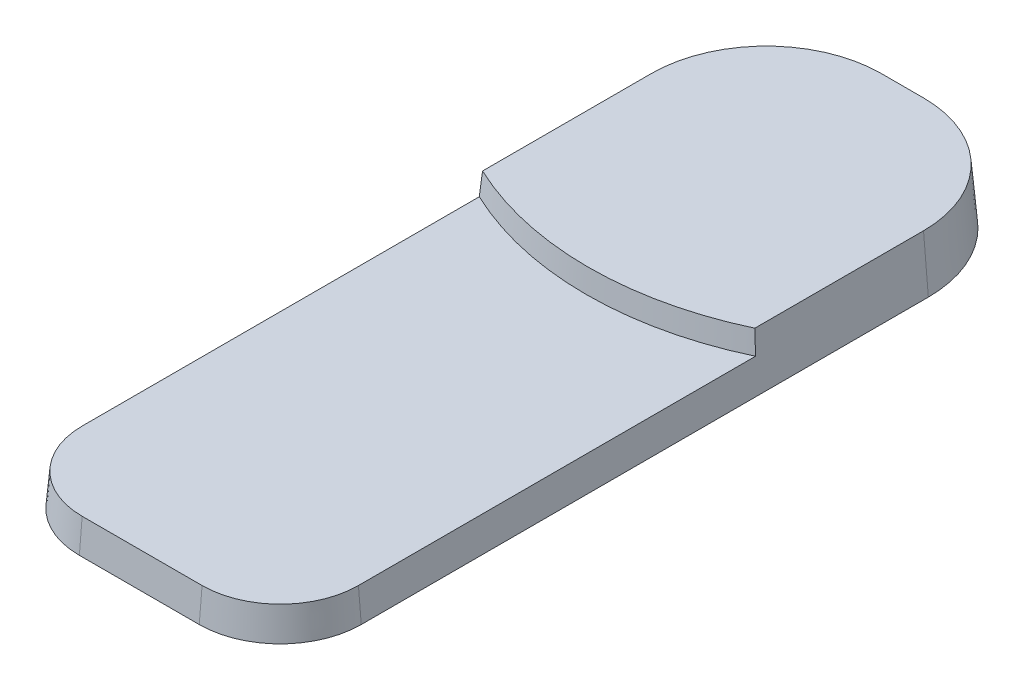
ISO-10303-21;
HEADER;
FILE_DESCRIPTION(('STEP AP214'),'2;1');
FILE_NAME('part.step','',(''),(''),'','','');
FILE_SCHEMA(('AUTOMOTIVE_DESIGN { 1 0 10303 214 1 1 1 1 }'));
ENDSEC;
DATA;
#1=APPLICATION_CONTEXT('core data for automotive mechanical design processes');
#2=APPLICATION_PROTOCOL_DEFINITION('international standard','automotive_design',2000,#1);
#3=PRODUCT_CONTEXT('',#1,'mechanical');
#4=PRODUCT('Part','Part','',(#3));
#5=PRODUCT_RELATED_PRODUCT_CATEGORY('part','',(#4));
#6=PRODUCT_DEFINITION_FORMATION('','',#4);
#7=PRODUCT_DEFINITION_CONTEXT('part definition',#1,'design');
#8=PRODUCT_DEFINITION('design','',#6,#7);
#9=PRODUCT_DEFINITION_SHAPE('','',#8);
#10=(LENGTH_UNIT() NAMED_UNIT(*) SI_UNIT(.MILLI.,.METRE.));
#11=(NAMED_UNIT(*) PLANE_ANGLE_UNIT() SI_UNIT($,.RADIAN.));
#12=(NAMED_UNIT(*) SI_UNIT($,.STERADIAN.) SOLID_ANGLE_UNIT());
#13=UNCERTAINTY_MEASURE_WITH_UNIT(LENGTH_MEASURE(1.E-05),#10,'distance_accuracy_value','');
#14=(GEOMETRIC_REPRESENTATION_CONTEXT(3) GLOBAL_UNCERTAINTY_ASSIGNED_CONTEXT((#13)) GLOBAL_UNIT_ASSIGNED_CONTEXT((#10,
#11,#12)) REPRESENTATION_CONTEXT('',''));
#15=CARTESIAN_POINT('',(0.,0.,0.));
#16=DIRECTION('',(0.,0.,1.));
#17=DIRECTION('',(1.,0.,0.));
#18=AXIS2_PLACEMENT_3D('',#15,#16,#17);
#19=CARTESIAN_POINT('',(21.75,0.,0.));
#20=DIRECTION('',(0.996194698091746,0.0871557427476584,0.));
#21=DIRECTION('',(-0.0871557427476584,0.996194698091746,0.));
#22=AXIS2_PLACEMENT_3D('',#19,#20,#21);
#23=PLANE('',#22);
#24=CARTESIAN_POINT('',(21.0063463600296,8.5,-14.7190696193512));
#25=CARTESIAN_POINT('',(21.130286677745,7.08335568609279,-14.6404831912155));
#26=CARTESIAN_POINT('',(21.2542279732764,5.66670019569655,-14.5621008421958));
#27=CARTESIAN_POINT('',(21.5021125199332,2.83336686236321,-14.4057443024122));
#28=CARTESIAN_POINT('',(21.6260557710585,1.41668901942611,-14.3277701116482));
#29=CARTESIAN_POINT('',(21.75,0.,-14.25));
#30=B_SPLINE_CURVE_WITH_KNOTS('',3,(#24,#25,#26,#27,#28,#29),.UNSPECIFIED.,.F.,.F.,(4,2,4),(0.,
4.27267622721533,8.5453524531121),.UNSPECIFIED.);
#31=CARTESIAN_POINT('',(21.0063463600296,8.5,-14.7190696193512));
#32=VERTEX_POINT('',#31);
#33=CARTESIAN_POINT('',(21.3125566823704,5.,-14.5253277920253));
#34=VERTEX_POINT('',#33);
#35=EDGE_CURVE('E124',#32,#34,#30,.T.);
#36=ORIENTED_EDGE('',*,*,#35,.T.);
#37=DIRECTION('',(0.,0.,1.));
#38=VECTOR('',#37,1.);
#39=CARTESIAN_POINT('',(21.3125566823704,5.,0.));
#40=LINE('',#39,#38);
#41=CARTESIAN_POINT('',(21.3125566823704,5.,46.7499999999999));
#42=VERTEX_POINT('',#41);
#43=EDGE_CURVE('E64',#34,#42,#40,.T.);
#44=ORIENTED_EDGE('',*,*,#43,.T.);
#45=DIRECTION('',(0.0871557427476584,-0.996194698091745,0.));
#46=VECTOR('',#45,1.);
#47=CARTESIAN_POINT('',(21.75,0.,46.7499999999999));
#48=LINE('',#47,#46);
#49=CARTESIAN_POINT('',(21.75,0.,46.7499999999999));
#50=VERTEX_POINT('',#49);
#51=EDGE_CURVE('E221',#42,#50,#48,.T.);
#52=ORIENTED_EDGE('',*,*,#51,.T.);
#53=DIRECTION('',(0.,0.,1.));
#54=VECTOR('',#53,1.);
#55=CARTESIAN_POINT('',(21.75,0.,0.));
#56=LINE('',#55,#54);
#57=CARTESIAN_POINT('',(21.75,0.,-40.7499999999999));
#58=VERTEX_POINT('',#57);
#59=EDGE_CURVE('E149',#58,#50,#56,.T.);
#60=ORIENTED_EDGE('',*,*,#59,.F.);
#61=DIRECTION('',(0.0871557427476584,-0.996194698091745,0.));
#62=VECTOR('',#61,1.);
#63=CARTESIAN_POINT('',(21.75,0.,-40.7499999999999));
#64=LINE('',#63,#62);
#65=CARTESIAN_POINT('',(21.0063463600296,8.5,-40.7499999999999));
#66=VERTEX_POINT('',#65);
#67=EDGE_CURVE('E11',#66,#58,#64,.T.);
#68=ORIENTED_EDGE('',*,*,#67,.F.);
#69=DIRECTION('',(0.,0.,1.));
#70=VECTOR('',#69,1.);
#71=CARTESIAN_POINT('',(21.0063463600296,8.5,0.));
#72=LINE('',#71,#70);
#73=EDGE_CURVE('E129',#66,#32,#72,.T.);
#74=ORIENTED_EDGE('',*,*,#73,.T.);
#75=EDGE_LOOP('',(#36,#44,#52,#60,#68,#74));
#76=FACE_BOUND('',#75,.T.);
#77=ADVANCED_FACE('F41',(#76),#23,.T.);
#78=CARTESIAN_POINT('',(3.24999999999999,0.,-40.75));
#79=DIRECTION('',(0.,-1.,0.));
#80=DIRECTION('',(0.,0.,1.));
#81=AXIS2_PLACEMENT_3D('',#78,#79,#80);
#82=CONICAL_SURFACE('',#81,18.5,0.0872664625997167);
#83=CARTESIAN_POINT('',(3.24999999999999,0.,-40.75));
#84=DIRECTION('',(0.,1.,0.));
#85=DIRECTION('',(0.,0.,1.));
#86=AXIS2_PLACEMENT_3D('',#83,#84,#85);
#87=CIRCLE('',#86,18.5);
#88=CARTESIAN_POINT('',(3.24999999999986,0.,-59.25));
#89=VERTEX_POINT('',#88);
#90=EDGE_CURVE('E273',#89,#58,#87,.F.);
#91=ORIENTED_EDGE('',*,*,#90,.F.);
#92=DIRECTION('',(0.,-0.996194698091745,-0.0871557427476584));
#93=VECTOR('',#92,1.);
#94=CARTESIAN_POINT('',(3.24999999999986,0.,-59.25));
#95=LINE('',#94,#93);
#96=CARTESIAN_POINT('',(3.24999999999986,8.5,-58.5063463600296));
#97=VERTEX_POINT('',#96);
#98=EDGE_CURVE('E51',#97,#89,#95,.T.);
#99=ORIENTED_EDGE('',*,*,#98,.F.);
#100=CARTESIAN_POINT('',(3.24999999999999,8.5,-40.75));
#101=DIRECTION('',(0.,1.,0.));
#102=DIRECTION('',(0.,0.,1.));
#103=AXIS2_PLACEMENT_3D('',#100,#101,#102);
#104=CIRCLE('',#103,17.7563463600296);
#105=EDGE_CURVE('E260',#97,#66,#104,.F.);
#106=ORIENTED_EDGE('',*,*,#105,.T.);
#107=ORIENTED_EDGE('',*,*,#67,.T.);
#108=EDGE_LOOP('',(#91,#99,#106,#107));
#109=FACE_BOUND('',#108,.T.);
#110=ADVANCED_FACE('F43',(#109),#82,.T.);
#111=CARTESIAN_POINT('',(0.,0.,-59.25));
#112=DIRECTION('',(0.,0.0871557427476584,-0.996194698091746));
#113=DIRECTION('',(0.,0.996194698091746,0.0871557427476584));
#114=AXIS2_PLACEMENT_3D('',#111,#112,#113);
#115=PLANE('',#114);
#116=DIRECTION('',(1.,0.,0.));
#117=VECTOR('',#116,1.);
#118=CARTESIAN_POINT('',(0.,0.,-59.25));
#119=LINE('',#118,#117);
#120=CARTESIAN_POINT('',(-3.24999999999988,0.,-59.25));
#121=VERTEX_POINT('',#120);
#122=EDGE_CURVE('E276',#121,#89,#119,.T.);
#123=ORIENTED_EDGE('',*,*,#122,.F.);
#124=DIRECTION('',(0.,-0.996194698091745,-0.0871557427476584));
#125=VECTOR('',#124,1.);
#126=CARTESIAN_POINT('',(-3.24999999999988,0.,-59.25));
#127=LINE('',#126,#125);
#128=CARTESIAN_POINT('',(-3.24999999999989,8.5,-58.5063463600296));
#129=VERTEX_POINT('',#128);
#130=EDGE_CURVE('E243',#129,#121,#127,.T.);
#131=ORIENTED_EDGE('',*,*,#130,.F.);
#132=DIRECTION('',(1.,0.,0.));
#133=VECTOR('',#132,1.);
#134=CARTESIAN_POINT('',(0.,8.5,-58.5063463600296));
#135=LINE('',#134,#133);
#136=EDGE_CURVE('E263',#129,#97,#135,.T.);
#137=ORIENTED_EDGE('',*,*,#136,.T.);
#138=ORIENTED_EDGE('',*,*,#98,.T.);
#139=EDGE_LOOP('',(#123,#131,#137,#138));
#140=FACE_BOUND('',#139,.T.);
#141=ADVANCED_FACE('F174',(#140),#115,.T.);
#142=CARTESIAN_POINT('',(-3.25000000000001,0.,-40.75));
#143=DIRECTION('',(0.,-1.,0.));
#144=DIRECTION('',(0.,0.,1.));
#145=AXIS2_PLACEMENT_3D('',#142,#143,#144);
#146=CONICAL_SURFACE('',#145,18.5,0.0872664625997167);
#147=CARTESIAN_POINT('',(-3.25000000000001,0.,-40.75));
#148=DIRECTION('',(0.,1.,0.));
#149=DIRECTION('',(0.,0.,1.));
#150=AXIS2_PLACEMENT_3D('',#147,#148,#149);
#151=CIRCLE('',#150,18.5);
#152=CARTESIAN_POINT('',(-21.75,0.,-40.7499999999999));
#153=VERTEX_POINT('',#152);
#154=EDGE_CURVE('E280',#121,#153,#151,.T.);
#155=ORIENTED_EDGE('',*,*,#154,.T.);
#156=DIRECTION('',(-0.0871557427476584,-0.996194698091745,0.));
#157=VECTOR('',#156,1.);
#158=CARTESIAN_POINT('',(-21.75,0.,-40.7499999999999));
#159=LINE('',#158,#157);
#160=CARTESIAN_POINT('',(-21.0063463600296,8.5,-40.7499999999999));
#161=VERTEX_POINT('',#160);
#162=EDGE_CURVE('E240',#161,#153,#159,.T.);
#163=ORIENTED_EDGE('',*,*,#162,.F.);
#164=CARTESIAN_POINT('',(-3.25000000000001,8.5,-40.75));
#165=DIRECTION('',(0.,1.,0.));
#166=DIRECTION('',(0.,0.,1.));
#167=AXIS2_PLACEMENT_3D('',#164,#165,#166);
#168=CIRCLE('',#167,17.7563463600296);
#169=EDGE_CURVE('E137',#129,#161,#168,.T.);
#170=ORIENTED_EDGE('',*,*,#169,.F.);
#171=ORIENTED_EDGE('',*,*,#130,.T.);
#172=EDGE_LOOP('',(#155,#163,#170,#171));
#173=FACE_BOUND('',#172,.T.);
#174=ADVANCED_FACE('F171',(#173),#146,.T.);
#175=CARTESIAN_POINT('',(-21.75,0.,0.));
#176=DIRECTION('',(-0.996194698091746,0.0871557427476584,0.));
#177=DIRECTION('',(-0.0871557427476584,-0.996194698091746,0.));
#178=AXIS2_PLACEMENT_3D('',#175,#176,#177);
#179=PLANE('',#178);
#180=DIRECTION('',(0.,0.,1.));
#181=VECTOR('',#180,1.);
#182=CARTESIAN_POINT('',(-21.75,0.,0.));
#183=LINE('',#182,#181);
#184=CARTESIAN_POINT('',(-21.75,0.,46.7499999999999));
#185=VERTEX_POINT('',#184);
#186=EDGE_CURVE('E283',#153,#185,#183,.T.);
#187=ORIENTED_EDGE('',*,*,#186,.T.);
#188=DIRECTION('',(-0.0871557427476584,-0.996194698091745,0.));
#189=VECTOR('',#188,1.);
#190=CARTESIAN_POINT('',(-21.75,0.,46.7499999999999));
#191=LINE('',#190,#189);
#192=CARTESIAN_POINT('',(-21.3125566823704,5.,46.7499999999999));
#193=VERTEX_POINT('',#192);
#194=EDGE_CURVE('E236',#193,#185,#191,.T.);
#195=ORIENTED_EDGE('',*,*,#194,.F.);
#196=DIRECTION('',(0.,0.,-1.));
#197=VECTOR('',#196,1.);
#198=CARTESIAN_POINT('',(-21.3125566823704,5.,0.));
#199=LINE('',#198,#197);
#200=CARTESIAN_POINT('',(-21.3125566823704,5.,-14.5253277920253));
#201=VERTEX_POINT('',#200);
#202=EDGE_CURVE('E144',#201,#193,#199,.F.);
#203=ORIENTED_EDGE('',*,*,#202,.F.);
#204=CARTESIAN_POINT('',(-21.0063463600296,8.5,-14.7190696193512));
#205=CARTESIAN_POINT('',(-21.130286677745,7.08335568609279,-14.6404831912155));
#206=CARTESIAN_POINT('',(-21.2542279732764,5.66670019569655,-14.5621008421958));
#207=CARTESIAN_POINT('',(-21.5021125199332,2.83336686236321,-14.4057443024122));
#208=CARTESIAN_POINT('',(-21.6260557710586,1.41668901942612,-14.3277701116482));
#209=CARTESIAN_POINT('',(-21.75,0.,-14.25));
#210=B_SPLINE_CURVE_WITH_KNOTS('',3,(#204,#205,#206,#207,#208,#209),.UNSPECIFIED.,.F.,.F.,(4,2,
4),(0.,4.27267622721533,8.5453524531121),.UNSPECIFIED.);
#211=CARTESIAN_POINT('',(-21.0063463600296,8.5,-14.7190696193512));
#212=VERTEX_POINT('',#211);
#213=EDGE_CURVE('E122',#212,#201,#210,.T.);
#214=ORIENTED_EDGE('',*,*,#213,.F.);
#215=DIRECTION('',(0.,0.,-1.));
#216=VECTOR('',#215,1.);
#217=CARTESIAN_POINT('',(-21.0063463600296,8.5,0.));
#218=LINE('',#217,#216);
#219=EDGE_CURVE('E130',#161,#212,#218,.F.);
#220=ORIENTED_EDGE('',*,*,#219,.F.);
#221=ORIENTED_EDGE('',*,*,#162,.T.);
#222=EDGE_LOOP('',(#187,#195,#203,#214,#220,#221));
#223=FACE_BOUND('',#222,.T.);
#224=ADVANCED_FACE('F142',(#223),#179,.T.);
#225=CARTESIAN_POINT('',(-9.25,0.,46.75));
#226=DIRECTION('',(0.,-1.,0.));
#227=DIRECTION('',(0.,0.,1.));
#228=AXIS2_PLACEMENT_3D('',#225,#226,#227);
#229=CONICAL_SURFACE('',#228,12.5,0.0872664625997167);
#230=CARTESIAN_POINT('',(-9.25,0.,46.75));
#231=DIRECTION('',(0.,1.,0.));
#232=DIRECTION('',(0.,0.,1.));
#233=AXIS2_PLACEMENT_3D('',#230,#231,#232);
#234=CIRCLE('',#233,12.5);
#235=CARTESIAN_POINT('',(-9.24999999999991,0.,59.25));
#236=VERTEX_POINT('',#235);
#237=EDGE_CURVE('E216',#236,#185,#234,.F.);
#238=ORIENTED_EDGE('',*,*,#237,.F.);
#239=DIRECTION('',(0.,-0.996194698091745,0.0871557427476584));
#240=VECTOR('',#239,1.);
#241=CARTESIAN_POINT('',(-9.24999999999991,0.,59.25));
#242=LINE('',#241,#240);
#243=CARTESIAN_POINT('',(-9.24999999999991,5.,58.8125566823704));
#244=VERTEX_POINT('',#243);
#245=EDGE_CURVE('E209',#244,#236,#242,.T.);
#246=ORIENTED_EDGE('',*,*,#245,.F.);
#247=CARTESIAN_POINT('',(-9.25,5.,46.75));
#248=DIRECTION('',(0.,1.,0.));
#249=DIRECTION('',(0.,0.,1.));
#250=AXIS2_PLACEMENT_3D('',#247,#248,#249);
#251=CIRCLE('',#250,12.0625566823704);
#252=EDGE_CURVE('E250',#244,#193,#251,.F.);
#253=ORIENTED_EDGE('',*,*,#252,.T.);
#254=ORIENTED_EDGE('',*,*,#194,.T.);
#255=EDGE_LOOP('',(#238,#246,#253,#254));
#256=FACE_BOUND('',#255,.T.);
#257=ADVANCED_FACE('F170',(#256),#229,.T.);
#258=CARTESIAN_POINT('',(0.,0.,59.25));
#259=DIRECTION('',(0.,0.0871557427476584,0.996194698091746));
#260=DIRECTION('',(0.,-0.996194698091746,0.0871557427476584));
#261=AXIS2_PLACEMENT_3D('',#258,#259,#260);
#262=PLANE('',#261);
#263=DIRECTION('',(1.,0.,0.));
#264=VECTOR('',#263,1.);
#265=CARTESIAN_POINT('',(0.,0.,59.25));
#266=LINE('',#265,#264);
#267=CARTESIAN_POINT('',(9.24999999999991,0.,59.25));
#268=VERTEX_POINT('',#267);
#269=EDGE_CURVE('E204',#236,#268,#266,.T.);
#270=ORIENTED_EDGE('',*,*,#269,.T.);
#271=DIRECTION('',(0.,-0.996194698091745,0.0871557427476583));
#272=VECTOR('',#271,1.);
#273=CARTESIAN_POINT('',(9.24999999999991,0.,59.25));
#274=LINE('',#273,#272);
#275=CARTESIAN_POINT('',(9.24999999999992,5.,58.8125566823704));
#276=VERTEX_POINT('',#275);
#277=EDGE_CURVE('E207',#276,#268,#274,.T.);
#278=ORIENTED_EDGE('',*,*,#277,.F.);
#279=DIRECTION('',(-1.,0.,0.));
#280=VECTOR('',#279,1.);
#281=CARTESIAN_POINT('',(0.,5.,58.8125566823704));
#282=LINE('',#281,#280);
#283=EDGE_CURVE('E253',#244,#276,#282,.F.);
#284=ORIENTED_EDGE('',*,*,#283,.F.);
#285=ORIENTED_EDGE('',*,*,#245,.T.);
#286=EDGE_LOOP('',(#270,#278,#284,#285));
#287=FACE_BOUND('',#286,.T.);
#288=ADVANCED_FACE('F194',(#287),#262,.T.);
#289=CARTESIAN_POINT('',(9.25,0.,46.75));
#290=DIRECTION('',(0.,-1.,0.));
#291=DIRECTION('',(0.,0.,1.));
#292=AXIS2_PLACEMENT_3D('',#289,#290,#291);
#293=CONICAL_SURFACE('',#292,12.5,0.0872664625997167);
#294=CARTESIAN_POINT('',(9.25,0.,46.75));
#295=DIRECTION('',(0.,1.,0.));
#296=DIRECTION('',(0.,0.,1.));
#297=AXIS2_PLACEMENT_3D('',#294,#295,#296);
#298=CIRCLE('',#297,12.5);
#299=EDGE_CURVE('E215',#268,#50,#298,.T.);
#300=ORIENTED_EDGE('',*,*,#299,.T.);
#301=ORIENTED_EDGE('',*,*,#51,.F.);
#302=CARTESIAN_POINT('',(9.25,5.,46.75));
#303=DIRECTION('',(0.,1.,0.));
#304=DIRECTION('',(0.,0.,1.));
#305=AXIS2_PLACEMENT_3D('',#302,#303,#304);
#306=CIRCLE('',#305,12.0625566823704);
#307=EDGE_CURVE('E45',#276,#42,#306,.T.);
#308=ORIENTED_EDGE('',*,*,#307,.F.);
#309=ORIENTED_EDGE('',*,*,#277,.T.);
#310=EDGE_LOOP('',(#300,#301,#308,#309));
#311=FACE_BOUND('',#310,.T.);
#312=ADVANCED_FACE('F191',(#311),#293,.T.);
#313=CARTESIAN_POINT('',(0.,5.,0.));
#314=DIRECTION('',(0.,1.,0.));
#315=DIRECTION('',(0.,0.,1.));
#316=AXIS2_PLACEMENT_3D('',#313,#314,#315);
#317=PLANE('',#316);
#318=ORIENTED_EDGE('',*,*,#43,.F.);
#319=CARTESIAN_POINT('',(0.,5.,-59.2715226308485));
#320=DIRECTION('',(0.,1.,0.));
#321=DIRECTION('',(0.,0.,1.));
#322=AXIS2_PLACEMENT_3D('',#319,#320,#321);
#323=CIRCLE('',#322,49.5625566823704);
#324=EDGE_CURVE('E59',#34,#201,#323,.F.);
#325=ORIENTED_EDGE('',*,*,#324,.T.);
#326=ORIENTED_EDGE('',*,*,#202,.T.);
#327=ORIENTED_EDGE('',*,*,#252,.F.);
#328=ORIENTED_EDGE('',*,*,#283,.T.);
#329=ORIENTED_EDGE('',*,*,#307,.T.);
#330=EDGE_LOOP('',(#318,#325,#326,#327,#328,#329));
#331=FACE_BOUND('',#330,.T.);
#332=ADVANCED_FACE('F193',(#331),#317,.T.);
#333=CARTESIAN_POINT('',(0.,0.,0.));
#334=DIRECTION('',(0.,1.,0.));
#335=DIRECTION('',(0.,0.,1.));
#336=AXIS2_PLACEMENT_3D('',#333,#334,#335);
#337=PLANE('',#336);
#338=ORIENTED_EDGE('',*,*,#237,.T.);
#339=ORIENTED_EDGE('',*,*,#186,.F.);
#340=ORIENTED_EDGE('',*,*,#154,.F.);
#341=ORIENTED_EDGE('',*,*,#122,.T.);
#342=ORIENTED_EDGE('',*,*,#90,.T.);
#343=ORIENTED_EDGE('',*,*,#59,.T.);
#344=ORIENTED_EDGE('',*,*,#299,.F.);
#345=ORIENTED_EDGE('',*,*,#269,.F.);
#346=EDGE_LOOP('',(#338,#339,#340,#341,#342,#343,#344,#345));
#347=FACE_BOUND('',#346,.T.);
#348=ADVANCED_FACE('F190',(#347),#337,.F.);
#349=CARTESIAN_POINT('',(0.,0.,-59.2715226308485));
#350=DIRECTION('',(0.,-1.,0.));
#351=DIRECTION('',(0.,0.,1.));
#352=AXIS2_PLACEMENT_3D('',#349,#350,#351);
#353=CONICAL_SURFACE('',#352,50.,0.0872664625997167);
#354=ORIENTED_EDGE('',*,*,#324,.F.);
#355=ORIENTED_EDGE('',*,*,#35,.F.);
#356=CARTESIAN_POINT('',(0.,8.5,-59.2715226308485));
#357=DIRECTION('',(0.,1.,0.));
#358=DIRECTION('',(0.,0.,1.));
#359=AXIS2_PLACEMENT_3D('',#356,#357,#358);
#360=CIRCLE('',#359,49.2563463600297);
#361=EDGE_CURVE('E118',#212,#32,#360,.T.);
#362=ORIENTED_EDGE('',*,*,#361,.F.);
#363=ORIENTED_EDGE('',*,*,#213,.T.);
#364=EDGE_LOOP('',(#354,#355,#362,#363));
#365=FACE_BOUND('',#364,.T.);
#366=ADVANCED_FACE('F120',(#365),#353,.T.);
#367=CARTESIAN_POINT('',(0.,8.5,0.));
#368=DIRECTION('',(0.,1.,0.));
#369=DIRECTION('',(0.,0.,1.));
#370=AXIS2_PLACEMENT_3D('',#367,#368,#369);
#371=PLANE('',#370);
#372=ORIENTED_EDGE('',*,*,#219,.T.);
#373=ORIENTED_EDGE('',*,*,#361,.T.);
#374=ORIENTED_EDGE('',*,*,#73,.F.);
#375=ORIENTED_EDGE('',*,*,#105,.F.);
#376=ORIENTED_EDGE('',*,*,#136,.F.);
#377=ORIENTED_EDGE('',*,*,#169,.T.);
#378=EDGE_LOOP('',(#372,#373,#374,#375,#376,#377));
#379=FACE_BOUND('',#378,.T.);
#380=ADVANCED_FACE('F134',(#379),#371,.T.);
#381=CLOSED_SHELL('',(#77,#110,#141,#174,#224,#257,#288,#312,#332,#348,#366,#380));
#382=MANIFOLD_SOLID_BREP('B2',#381);
#383=ADVANCED_BREP_SHAPE_REPRESENTATION('',(#18,#382),#14);
#384=SHAPE_DEFINITION_REPRESENTATION(#9,#383);
ENDSEC;
END-ISO-10303-21;
